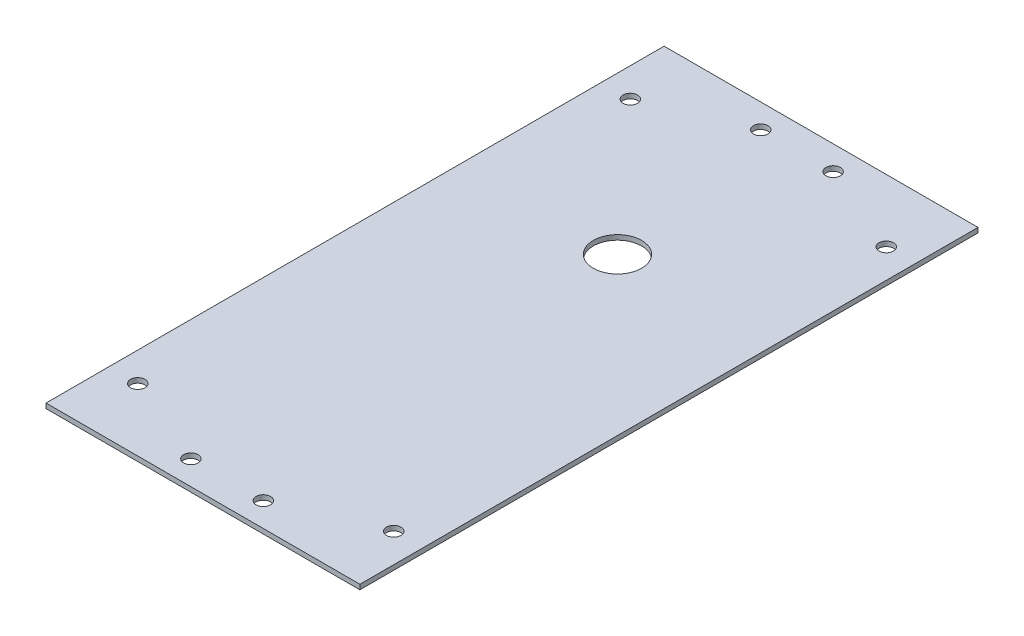
ISO-10303-21;
HEADER;
FILE_DESCRIPTION(('STEP AP214'),'2;1');
FILE_NAME('part.step','',(''),(''),'','','');
FILE_SCHEMA(('AUTOMOTIVE_DESIGN { 1 0 10303 214 1 1 1 1 }'));
ENDSEC;
DATA;
#1=APPLICATION_CONTEXT('core data for automotive mechanical design processes');
#2=APPLICATION_PROTOCOL_DEFINITION('international standard','automotive_design',2000,#1);
#3=PRODUCT_CONTEXT('',#1,'mechanical');
#4=PRODUCT('Part','Part','',(#3));
#5=PRODUCT_RELATED_PRODUCT_CATEGORY('part','',(#4));
#6=PRODUCT_DEFINITION_FORMATION('','',#4);
#7=PRODUCT_DEFINITION_CONTEXT('part definition',#1,'design');
#8=PRODUCT_DEFINITION('design','',#6,#7);
#9=PRODUCT_DEFINITION_SHAPE('','',#8);
#10=(LENGTH_UNIT() NAMED_UNIT(*) SI_UNIT(.MILLI.,.METRE.));
#11=(NAMED_UNIT(*) PLANE_ANGLE_UNIT() SI_UNIT($,.RADIAN.));
#12=(NAMED_UNIT(*) SI_UNIT($,.STERADIAN.) SOLID_ANGLE_UNIT());
#13=UNCERTAINTY_MEASURE_WITH_UNIT(LENGTH_MEASURE(1.E-05),#10,'distance_accuracy_value','');
#14=(GEOMETRIC_REPRESENTATION_CONTEXT(3) GLOBAL_UNCERTAINTY_ASSIGNED_CONTEXT((#13)) GLOBAL_UNIT_ASSIGNED_CONTEXT((#10,
#11,#12)) REPRESENTATION_CONTEXT('',''));
#15=CARTESIAN_POINT('',(0.,0.,0.));
#16=DIRECTION('',(0.,0.,1.));
#17=DIRECTION('',(1.,0.,0.));
#18=AXIS2_PLACEMENT_3D('',#15,#16,#17);
#19=CARTESIAN_POINT('',(0.,1.,0.));
#20=DIRECTION('',(0.,1.,0.));
#21=DIRECTION('',(0.,0.,1.));
#22=AXIS2_PLACEMENT_3D('',#19,#20,#21);
#23=PLANE('',#22);
#24=CARTESIAN_POINT('',(-41.8584589303663,1.,-11.4815410696336));
#25=DIRECTION('',(0.,1.,0.));
#26=DIRECTION('',(0.,0.,1.));
#27=AXIS2_PLACEMENT_3D('',#24,#25,#26);
#28=CIRCLE('',#27,5.);
#29=CARTESIAN_POINT('',(-41.8584589303663,1.,-6.48154106963364));
#30=VERTEX_POINT('',#29);
#31=EDGE_CURVE('E163',#30,#30,#28,.T.);
#32=ORIENTED_EDGE('',*,*,#31,.F.);
#33=EDGE_LOOP('',(#32));
#34=FACE_BOUND('',#33,.T.);
#35=CARTESIAN_POINT('',(-34.3584589303663,1.,-48.6415410696337));
#36=DIRECTION('',(0.,1.,0.));
#37=DIRECTION('',(0.,0.,-1.));
#38=AXIS2_PLACEMENT_3D('',#35,#36,#37);
#39=CIRCLE('',#38,1.5);
#40=CARTESIAN_POINT('',(-34.3584589303663,1.,-50.1415410696337));
#41=VERTEX_POINT('',#40);
#42=EDGE_CURVE('E158',#41,#41,#39,.T.);
#43=ORIENTED_EDGE('',*,*,#42,.F.);
#44=EDGE_LOOP('',(#43));
#45=FACE_BOUND('',#44,.T.);
#46=CARTESIAN_POINT('',(-34.3584589303663,1.,69.3584589303664));
#47=DIRECTION('',(0.,1.,0.));
#48=DIRECTION('',(0.,0.,1.));
#49=AXIS2_PLACEMENT_3D('',#46,#47,#48);
#50=CIRCLE('',#49,1.5);
#51=CARTESIAN_POINT('',(-34.3584589303663,1.,70.8584589303664));
#52=VERTEX_POINT('',#51);
#53=EDGE_CURVE('E152',#52,#52,#50,.T.);
#54=ORIENTED_EDGE('',*,*,#53,.F.);
#55=EDGE_LOOP('',(#54));
#56=FACE_BOUND('',#55,.T.);
#57=CARTESIAN_POINT('',(-49.3584589303663,1.,69.3584589303664));
#58=DIRECTION('',(0.,1.,0.));
#59=DIRECTION('',(0.,0.,-1.));
#60=AXIS2_PLACEMENT_3D('',#57,#58,#59);
#61=CIRCLE('',#60,1.5);
#62=CARTESIAN_POINT('',(-49.3584589303663,1.,67.8584589303664));
#63=VERTEX_POINT('',#62);
#64=EDGE_CURVE('E146',#63,#63,#61,.T.);
#65=ORIENTED_EDGE('',*,*,#64,.F.);
#66=EDGE_LOOP('',(#65));
#67=FACE_BOUND('',#66,.T.);
#68=CARTESIAN_POINT('',(-49.3584589303663,1.,-48.6415410696337));
#69=DIRECTION('',(0.,1.,0.));
#70=DIRECTION('',(0.,0.,1.));
#71=AXIS2_PLACEMENT_3D('',#68,#69,#70);
#72=CIRCLE('',#71,1.5);
#73=CARTESIAN_POINT('',(-49.3584589303663,1.,-47.1415410696337));
#74=VERTEX_POINT('',#73);
#75=EDGE_CURVE('E140',#74,#74,#72,.T.);
#76=ORIENTED_EDGE('',*,*,#75,.F.);
#77=EDGE_LOOP('',(#76));
#78=FACE_BOUND('',#77,.T.);
#79=CARTESIAN_POINT('',(-15.3584589303663,1.,61.3584589303664));
#80=DIRECTION('',(0.,1.,0.));
#81=DIRECTION('',(0.,0.,1.));
#82=AXIS2_PLACEMENT_3D('',#79,#80,#81);
#83=CIRCLE('',#82,1.5);
#84=CARTESIAN_POINT('',(-15.3584589303663,1.,62.8584589303664));
#85=VERTEX_POINT('',#84);
#86=EDGE_CURVE('E125',#85,#85,#83,.T.);
#87=ORIENTED_EDGE('',*,*,#86,.F.);
#88=EDGE_LOOP('',(#87));
#89=FACE_BOUND('',#88,.T.);
#90=CARTESIAN_POINT('',(-68.3584589303663,1.,-40.6415410696336));
#91=DIRECTION('',(0.,1.,0.));
#92=DIRECTION('',(0.,0.,1.));
#93=AXIS2_PLACEMENT_3D('',#90,#91,#92);
#94=CIRCLE('',#93,1.5);
#95=CARTESIAN_POINT('',(-68.3584589303663,1.,-39.1415410696337));
#96=VERTEX_POINT('',#95);
#97=EDGE_CURVE('E104',#96,#96,#94,.T.);
#98=ORIENTED_EDGE('',*,*,#97,.F.);
#99=EDGE_LOOP('',(#98));
#100=FACE_BOUND('',#99,.T.);
#101=DIRECTION('',(0.,0.,-1.));
#102=VECTOR('',#101,1.);
#103=CARTESIAN_POINT('',(-9.3584589303663,1.,-53.6415410696336));
#104=LINE('',#103,#102);
#105=CARTESIAN_POINT('',(-9.3584589303663,1.,74.3584589303663));
#106=VERTEX_POINT('',#105);
#107=CARTESIAN_POINT('',(-9.3584589303663,1.,-53.6415410696336));
#108=VERTEX_POINT('',#107);
#109=EDGE_CURVE('E88',#106,#108,#104,.T.);
#110=ORIENTED_EDGE('',*,*,#109,.T.);
#111=DIRECTION('',(-1.,0.,0.));
#112=VECTOR('',#111,1.);
#113=CARTESIAN_POINT('',(-74.3584589303663,1.,-53.6415410696336));
#114=LINE('',#113,#112);
#115=CARTESIAN_POINT('',(-74.3584589303663,1.,-53.6415410696336));
#116=VERTEX_POINT('',#115);
#117=EDGE_CURVE('E83',#108,#116,#114,.T.);
#118=ORIENTED_EDGE('',*,*,#117,.T.);
#119=DIRECTION('',(0.,0.,1.));
#120=VECTOR('',#119,1.);
#121=CARTESIAN_POINT('',(-74.3584589303663,1.,-53.6415410696336));
#122=LINE('',#121,#120);
#123=CARTESIAN_POINT('',(-74.3584589303663,1.,74.3584589303664));
#124=VERTEX_POINT('',#123);
#125=EDGE_CURVE('E86',#116,#124,#122,.T.);
#126=ORIENTED_EDGE('',*,*,#125,.T.);
#127=DIRECTION('',(1.,0.,0.));
#128=VECTOR('',#127,1.);
#129=CARTESIAN_POINT('',(-74.3584589303663,1.,74.3584589303664));
#130=LINE('',#129,#128);
#131=EDGE_CURVE('E53',#124,#106,#130,.T.);
#132=ORIENTED_EDGE('',*,*,#131,.T.);
#133=EDGE_LOOP('',(#110,#118,#126,#132));
#134=FACE_BOUND('',#133,.T.);
#135=CARTESIAN_POINT('',(-15.3584589303663,1.,-40.6415410696337));
#136=DIRECTION('',(0.,1.,0.));
#137=DIRECTION('',(0.,0.,-1.));
#138=AXIS2_PLACEMENT_3D('',#135,#136,#137);
#139=CIRCLE('',#138,1.5);
#140=CARTESIAN_POINT('',(-15.3584589303663,1.,-42.1415410696337));
#141=VERTEX_POINT('',#140);
#142=EDGE_CURVE('E119',#141,#141,#139,.T.);
#143=ORIENTED_EDGE('',*,*,#142,.F.);
#144=EDGE_LOOP('',(#143));
#145=FACE_BOUND('',#144,.T.);
#146=CARTESIAN_POINT('',(-68.3584589303663,1.,61.3584589303664));
#147=DIRECTION('',(0.,1.,0.));
#148=DIRECTION('',(0.,0.,-1.));
#149=AXIS2_PLACEMENT_3D('',#146,#147,#148);
#150=CIRCLE('',#149,1.5);
#151=CARTESIAN_POINT('',(-68.3584589303663,1.,59.8584589303664));
#152=VERTEX_POINT('',#151);
#153=EDGE_CURVE('E131',#152,#152,#150,.T.);
#154=ORIENTED_EDGE('',*,*,#153,.F.);
#155=EDGE_LOOP('',(#154));
#156=FACE_BOUND('',#155,.T.);
#157=ADVANCED_FACE('F35',(#34,#45,#56,#67,#78,#89,#100,#134,#145,#156),#23,.T.);
#158=CARTESIAN_POINT('',(0.,0.,0.));
#159=DIRECTION('',(0.,1.,0.));
#160=DIRECTION('',(0.,0.,1.));
#161=AXIS2_PLACEMENT_3D('',#158,#159,#160);
#162=PLANE('',#161);
#163=CARTESIAN_POINT('',(-41.8584589303663,0.,-11.4815410696336));
#164=DIRECTION('',(0.,1.,0.));
#165=DIRECTION('',(0.,0.,1.));
#166=AXIS2_PLACEMENT_3D('',#163,#164,#165);
#167=CIRCLE('',#166,5.);
#168=CARTESIAN_POINT('',(-41.8584589303663,0.,-6.48154106963364));
#169=VERTEX_POINT('',#168);
#170=EDGE_CURVE('E39',#169,#169,#167,.T.);
#171=ORIENTED_EDGE('',*,*,#170,.T.);
#172=EDGE_LOOP('',(#171));
#173=FACE_BOUND('',#172,.T.);
#174=CARTESIAN_POINT('',(-34.3584589303663,0.,-48.6415410696337));
#175=DIRECTION('',(0.,1.,0.));
#176=DIRECTION('',(0.,0.,-1.));
#177=AXIS2_PLACEMENT_3D('',#174,#175,#176);
#178=CIRCLE('',#177,1.5);
#179=CARTESIAN_POINT('',(-34.3584589303663,0.,-50.1415410696337));
#180=VERTEX_POINT('',#179);
#181=EDGE_CURVE('E143',#180,#180,#178,.T.);
#182=ORIENTED_EDGE('',*,*,#181,.T.);
#183=EDGE_LOOP('',(#182));
#184=FACE_BOUND('',#183,.T.);
#185=CARTESIAN_POINT('',(-34.3584589303663,0.,69.3584589303664));
#186=DIRECTION('',(0.,1.,0.));
#187=DIRECTION('',(0.,0.,1.));
#188=AXIS2_PLACEMENT_3D('',#185,#186,#187);
#189=CIRCLE('',#188,1.5);
#190=CARTESIAN_POINT('',(-34.3584589303663,0.,70.8584589303664));
#191=VERTEX_POINT('',#190);
#192=EDGE_CURVE('E155',#191,#191,#189,.T.);
#193=ORIENTED_EDGE('',*,*,#192,.T.);
#194=EDGE_LOOP('',(#193));
#195=FACE_BOUND('',#194,.T.);
#196=CARTESIAN_POINT('',(-49.3584589303663,0.,69.3584589303664));
#197=DIRECTION('',(0.,1.,0.));
#198=DIRECTION('',(0.,0.,-1.));
#199=AXIS2_PLACEMENT_3D('',#196,#197,#198);
#200=CIRCLE('',#199,1.5);
#201=CARTESIAN_POINT('',(-49.3584589303663,0.,67.8584589303664));
#202=VERTEX_POINT('',#201);
#203=EDGE_CURVE('E149',#202,#202,#200,.T.);
#204=ORIENTED_EDGE('',*,*,#203,.T.);
#205=EDGE_LOOP('',(#204));
#206=FACE_BOUND('',#205,.T.);
#207=CARTESIAN_POINT('',(-49.3584589303663,0.,-48.6415410696337));
#208=DIRECTION('',(0.,1.,0.));
#209=DIRECTION('',(0.,0.,1.));
#210=AXIS2_PLACEMENT_3D('',#207,#208,#209);
#211=CIRCLE('',#210,1.5);
#212=CARTESIAN_POINT('',(-49.3584589303663,0.,-47.1415410696337));
#213=VERTEX_POINT('',#212);
#214=EDGE_CURVE('E137',#213,#213,#211,.T.);
#215=ORIENTED_EDGE('',*,*,#214,.T.);
#216=EDGE_LOOP('',(#215));
#217=FACE_BOUND('',#216,.T.);
#218=DIRECTION('',(0.,0.,-1.));
#219=VECTOR('',#218,1.);
#220=CARTESIAN_POINT('',(-9.3584589303663,0.,-53.6415410696336));
#221=LINE('',#220,#219);
#222=CARTESIAN_POINT('',(-9.3584589303663,0.,74.3584589303663));
#223=VERTEX_POINT('',#222);
#224=CARTESIAN_POINT('',(-9.3584589303663,0.,-53.6415410696336));
#225=VERTEX_POINT('',#224);
#226=EDGE_CURVE('E101',#223,#225,#221,.T.);
#227=ORIENTED_EDGE('',*,*,#226,.F.);
#228=DIRECTION('',(1.,0.,0.));
#229=VECTOR('',#228,1.);
#230=CARTESIAN_POINT('',(-74.3584589303663,0.,74.3584589303664));
#231=LINE('',#230,#229);
#232=CARTESIAN_POINT('',(-74.3584589303663,0.,74.3584589303664));
#233=VERTEX_POINT('',#232);
#234=EDGE_CURVE('E76',#233,#223,#231,.T.);
#235=ORIENTED_EDGE('',*,*,#234,.F.);
#236=DIRECTION('',(0.,0.,1.));
#237=VECTOR('',#236,1.);
#238=CARTESIAN_POINT('',(-74.3584589303663,0.,-53.6415410696336));
#239=LINE('',#238,#237);
#240=CARTESIAN_POINT('',(-74.3584589303663,0.,-53.6415410696336));
#241=VERTEX_POINT('',#240);
#242=EDGE_CURVE('E70',#241,#233,#239,.T.);
#243=ORIENTED_EDGE('',*,*,#242,.F.);
#244=DIRECTION('',(-1.,0.,0.));
#245=VECTOR('',#244,1.);
#246=CARTESIAN_POINT('',(-74.3584589303663,0.,-53.6415410696336));
#247=LINE('',#246,#245);
#248=EDGE_CURVE('E92',#225,#241,#247,.T.);
#249=ORIENTED_EDGE('',*,*,#248,.F.);
#250=EDGE_LOOP('',(#227,#235,#243,#249));
#251=FACE_BOUND('',#250,.T.);
#252=CARTESIAN_POINT('',(-68.3584589303663,0.,-40.6415410696336));
#253=DIRECTION('',(0.,1.,0.));
#254=DIRECTION('',(0.,0.,1.));
#255=AXIS2_PLACEMENT_3D('',#252,#253,#254);
#256=CIRCLE('',#255,1.5);
#257=CARTESIAN_POINT('',(-68.3584589303663,0.,-39.1415410696337));
#258=VERTEX_POINT('',#257);
#259=EDGE_CURVE('E116',#258,#258,#256,.T.);
#260=ORIENTED_EDGE('',*,*,#259,.T.);
#261=EDGE_LOOP('',(#260));
#262=FACE_BOUND('',#261,.T.);
#263=CARTESIAN_POINT('',(-15.3584589303663,0.,-40.6415410696337));
#264=DIRECTION('',(0.,1.,0.));
#265=DIRECTION('',(0.,0.,-1.));
#266=AXIS2_PLACEMENT_3D('',#263,#264,#265);
#267=CIRCLE('',#266,1.5);
#268=CARTESIAN_POINT('',(-15.3584589303663,0.,-42.1415410696337));
#269=VERTEX_POINT('',#268);
#270=EDGE_CURVE('E122',#269,#269,#267,.T.);
#271=ORIENTED_EDGE('',*,*,#270,.T.);
#272=EDGE_LOOP('',(#271));
#273=FACE_BOUND('',#272,.T.);
#274=CARTESIAN_POINT('',(-15.3584589303663,0.,61.3584589303664));
#275=DIRECTION('',(0.,1.,0.));
#276=DIRECTION('',(0.,0.,1.));
#277=AXIS2_PLACEMENT_3D('',#274,#275,#276);
#278=CIRCLE('',#277,1.5);
#279=CARTESIAN_POINT('',(-15.3584589303663,0.,62.8584589303664));
#280=VERTEX_POINT('',#279);
#281=EDGE_CURVE('E128',#280,#280,#278,.T.);
#282=ORIENTED_EDGE('',*,*,#281,.T.);
#283=EDGE_LOOP('',(#282));
#284=FACE_BOUND('',#283,.T.);
#285=CARTESIAN_POINT('',(-68.3584589303663,0.,61.3584589303664));
#286=DIRECTION('',(0.,1.,0.));
#287=DIRECTION('',(0.,0.,-1.));
#288=AXIS2_PLACEMENT_3D('',#285,#286,#287);
#289=CIRCLE('',#288,1.5);
#290=CARTESIAN_POINT('',(-68.3584589303663,0.,59.8584589303664));
#291=VERTEX_POINT('',#290);
#292=EDGE_CURVE('E134',#291,#291,#289,.T.);
#293=ORIENTED_EDGE('',*,*,#292,.T.);
#294=EDGE_LOOP('',(#293));
#295=FACE_BOUND('',#294,.T.);
#296=ADVANCED_FACE('F112',(#173,#184,#195,#206,#217,#251,#262,#273,#284,#295),#162,.F.);
#297=CARTESIAN_POINT('',(-9.3584589303663,1.,-53.6415410696336));
#298=DIRECTION('',(-1.,0.,0.));
#299=DIRECTION('',(0.,0.,1.));
#300=AXIS2_PLACEMENT_3D('',#297,#298,#299);
#301=PLANE('',#300);
#302=ORIENTED_EDGE('',*,*,#226,.T.);
#303=DIRECTION('',(0.,-1.,0.));
#304=VECTOR('',#303,1.);
#305=CARTESIAN_POINT('',(-9.3584589303663,1.,-53.6415410696336));
#306=LINE('',#305,#304);
#307=EDGE_CURVE('E11',#108,#225,#306,.T.);
#308=ORIENTED_EDGE('',*,*,#307,.F.);
#309=ORIENTED_EDGE('',*,*,#109,.F.);
#310=DIRECTION('',(0.,-1.,0.));
#311=VECTOR('',#310,1.);
#312=CARTESIAN_POINT('',(-9.3584589303663,1.,74.3584589303663));
#313=LINE('',#312,#311);
#314=EDGE_CURVE('E97',#106,#223,#313,.T.);
#315=ORIENTED_EDGE('',*,*,#314,.T.);
#316=EDGE_LOOP('',(#302,#308,#309,#315));
#317=FACE_BOUND('',#316,.T.);
#318=ADVANCED_FACE('F37',(#317),#301,.F.);
#319=CARTESIAN_POINT('',(-74.3584589303663,1.,-53.6415410696336));
#320=DIRECTION('',(0.,0.,1.));
#321=DIRECTION('',(1.,0.,0.));
#322=AXIS2_PLACEMENT_3D('',#319,#320,#321);
#323=PLANE('',#322);
#324=ORIENTED_EDGE('',*,*,#248,.T.);
#325=DIRECTION('',(0.,-1.,0.));
#326=VECTOR('',#325,1.);
#327=CARTESIAN_POINT('',(-74.3584589303663,1.,-53.6415410696336));
#328=LINE('',#327,#326);
#329=EDGE_CURVE('E45',#116,#241,#328,.T.);
#330=ORIENTED_EDGE('',*,*,#329,.F.);
#331=ORIENTED_EDGE('',*,*,#117,.F.);
#332=ORIENTED_EDGE('',*,*,#307,.T.);
#333=EDGE_LOOP('',(#324,#330,#331,#332));
#334=FACE_BOUND('',#333,.T.);
#335=ADVANCED_FACE('F91',(#334),#323,.F.);
#336=CARTESIAN_POINT('',(-74.3584589303663,1.,-53.6415410696336));
#337=DIRECTION('',(1.,0.,0.));
#338=DIRECTION('',(0.,0.,-1.));
#339=AXIS2_PLACEMENT_3D('',#336,#337,#338);
#340=PLANE('',#339);
#341=ORIENTED_EDGE('',*,*,#242,.T.);
#342=DIRECTION('',(0.,-1.,0.));
#343=VECTOR('',#342,1.);
#344=CARTESIAN_POINT('',(-74.3584589303663,1.,74.3584589303664));
#345=LINE('',#344,#343);
#346=EDGE_CURVE('E93',#124,#233,#345,.T.);
#347=ORIENTED_EDGE('',*,*,#346,.F.);
#348=ORIENTED_EDGE('',*,*,#125,.F.);
#349=ORIENTED_EDGE('',*,*,#329,.T.);
#350=EDGE_LOOP('',(#341,#347,#348,#349));
#351=FACE_BOUND('',#350,.T.);
#352=ADVANCED_FACE('F95',(#351),#340,.F.);
#353=CARTESIAN_POINT('',(-74.3584589303663,1.,74.3584589303664));
#354=DIRECTION('',(0.,0.,-1.));
#355=DIRECTION('',(-1.,0.,0.));
#356=AXIS2_PLACEMENT_3D('',#353,#354,#355);
#357=PLANE('',#356);
#358=ORIENTED_EDGE('',*,*,#234,.T.);
#359=ORIENTED_EDGE('',*,*,#314,.F.);
#360=ORIENTED_EDGE('',*,*,#131,.F.);
#361=ORIENTED_EDGE('',*,*,#346,.T.);
#362=EDGE_LOOP('',(#358,#359,#360,#361));
#363=FACE_BOUND('',#362,.T.);
#364=ADVANCED_FACE('F109',(#363),#357,.F.);
#365=CARTESIAN_POINT('',(-68.3584589303663,1.,-40.6415410696336));
#366=DIRECTION('',(0.,-1.,0.));
#367=DIRECTION('',(0.,0.,-1.));
#368=AXIS2_PLACEMENT_3D('',#365,#366,#367);
#369=CYLINDRICAL_SURFACE('',#368,1.5);
#370=ORIENTED_EDGE('',*,*,#97,.T.);
#371=EDGE_LOOP('',(#370));
#372=FACE_BOUND('',#371,.T.);
#373=ORIENTED_EDGE('',*,*,#259,.F.);
#374=EDGE_LOOP('',(#373));
#375=FACE_BOUND('',#374,.T.);
#376=ADVANCED_FACE('F192',(#372,#375),#369,.F.);
#377=CARTESIAN_POINT('',(-15.3584589303663,1.,-40.6415410696337));
#378=DIRECTION('',(0.,-1.,0.));
#379=DIRECTION('',(0.,0.,-1.));
#380=AXIS2_PLACEMENT_3D('',#377,#378,#379);
#381=CYLINDRICAL_SURFACE('',#380,1.5);
#382=ORIENTED_EDGE('',*,*,#142,.T.);
#383=EDGE_LOOP('',(#382));
#384=FACE_BOUND('',#383,.T.);
#385=ORIENTED_EDGE('',*,*,#270,.F.);
#386=EDGE_LOOP('',(#385));
#387=FACE_BOUND('',#386,.T.);
#388=ADVANCED_FACE('F266',(#384,#387),#381,.F.);
#389=CARTESIAN_POINT('',(-15.3584589303663,1.,61.3584589303664));
#390=DIRECTION('',(0.,-1.,0.));
#391=DIRECTION('',(0.,0.,-1.));
#392=AXIS2_PLACEMENT_3D('',#389,#390,#391);
#393=CYLINDRICAL_SURFACE('',#392,1.5);
#394=ORIENTED_EDGE('',*,*,#86,.T.);
#395=EDGE_LOOP('',(#394));
#396=FACE_BOUND('',#395,.T.);
#397=ORIENTED_EDGE('',*,*,#281,.F.);
#398=EDGE_LOOP('',(#397));
#399=FACE_BOUND('',#398,.T.);
#400=ADVANCED_FACE('F257',(#396,#399),#393,.F.);
#401=CARTESIAN_POINT('',(-68.3584589303663,1.,61.3584589303664));
#402=DIRECTION('',(0.,-1.,0.));
#403=DIRECTION('',(0.,0.,-1.));
#404=AXIS2_PLACEMENT_3D('',#401,#402,#403);
#405=CYLINDRICAL_SURFACE('',#404,1.5);
#406=ORIENTED_EDGE('',*,*,#153,.T.);
#407=EDGE_LOOP('',(#406));
#408=FACE_BOUND('',#407,.T.);
#409=ORIENTED_EDGE('',*,*,#292,.F.);
#410=EDGE_LOOP('',(#409));
#411=FACE_BOUND('',#410,.T.);
#412=ADVANCED_FACE('F248',(#408,#411),#405,.F.);
#413=CARTESIAN_POINT('',(-49.3584589303663,0.,-48.6415410696337));
#414=DIRECTION('',(0.,1.,0.));
#415=DIRECTION('',(0.,0.,1.));
#416=AXIS2_PLACEMENT_3D('',#413,#414,#415);
#417=CYLINDRICAL_SURFACE('',#416,1.5);
#418=ORIENTED_EDGE('',*,*,#214,.F.);
#419=EDGE_LOOP('',(#418));
#420=FACE_BOUND('',#419,.T.);
#421=ORIENTED_EDGE('',*,*,#75,.T.);
#422=EDGE_LOOP('',(#421));
#423=FACE_BOUND('',#422,.T.);
#424=ADVANCED_FACE('F239',(#420,#423),#417,.F.);
#425=CARTESIAN_POINT('',(-49.3584589303663,0.,69.3584589303664));
#426=DIRECTION('',(0.,1.,0.));
#427=DIRECTION('',(0.,0.,1.));
#428=AXIS2_PLACEMENT_3D('',#425,#426,#427);
#429=CYLINDRICAL_SURFACE('',#428,1.5);
#430=ORIENTED_EDGE('',*,*,#203,.F.);
#431=EDGE_LOOP('',(#430));
#432=FACE_BOUND('',#431,.T.);
#433=ORIENTED_EDGE('',*,*,#64,.T.);
#434=EDGE_LOOP('',(#433));
#435=FACE_BOUND('',#434,.T.);
#436=ADVANCED_FACE('F230',(#432,#435),#429,.F.);
#437=CARTESIAN_POINT('',(-34.3584589303663,0.,69.3584589303664));
#438=DIRECTION('',(0.,1.,0.));
#439=DIRECTION('',(0.,0.,1.));
#440=AXIS2_PLACEMENT_3D('',#437,#438,#439);
#441=CYLINDRICAL_SURFACE('',#440,1.5);
#442=ORIENTED_EDGE('',*,*,#192,.F.);
#443=EDGE_LOOP('',(#442));
#444=FACE_BOUND('',#443,.T.);
#445=ORIENTED_EDGE('',*,*,#53,.T.);
#446=EDGE_LOOP('',(#445));
#447=FACE_BOUND('',#446,.T.);
#448=ADVANCED_FACE('F179',(#444,#447),#441,.F.);
#449=CARTESIAN_POINT('',(-34.3584589303663,0.,-48.6415410696337));
#450=DIRECTION('',(0.,1.,0.));
#451=DIRECTION('',(0.,0.,1.));
#452=AXIS2_PLACEMENT_3D('',#449,#450,#451);
#453=CYLINDRICAL_SURFACE('',#452,1.5);
#454=ORIENTED_EDGE('',*,*,#181,.F.);
#455=EDGE_LOOP('',(#454));
#456=FACE_BOUND('',#455,.T.);
#457=ORIENTED_EDGE('',*,*,#42,.T.);
#458=EDGE_LOOP('',(#457));
#459=FACE_BOUND('',#458,.T.);
#460=ADVANCED_FACE('F174',(#456,#459),#453,.F.);
#461=CARTESIAN_POINT('',(-41.8584589303663,-9.,-11.4815410696336));
#462=DIRECTION('',(0.,1.,0.));
#463=DIRECTION('',(0.,0.,1.));
#464=AXIS2_PLACEMENT_3D('',#461,#462,#463);
#465=CYLINDRICAL_SURFACE('',#464,5.);
#466=ORIENTED_EDGE('',*,*,#31,.T.);
#467=EDGE_LOOP('',(#466));
#468=FACE_BOUND('',#467,.T.);
#469=ORIENTED_EDGE('',*,*,#170,.F.);
#470=EDGE_LOOP('',(#469));
#471=FACE_BOUND('',#470,.T.);
#472=ADVANCED_FACE('F172',(#468,#471),#465,.F.);
#473=CLOSED_SHELL('',(#157,#296,#318,#335,#352,#364,#376,#388,#400,#412,#424,#436,#448,#460,#472));
#474=MANIFOLD_SOLID_BREP('B2',#473);
#475=ADVANCED_BREP_SHAPE_REPRESENTATION('',(#18,#474),#14);
#476=SHAPE_DEFINITION_REPRESENTATION(#9,#475);
ENDSEC;
END-ISO-10303-21;
